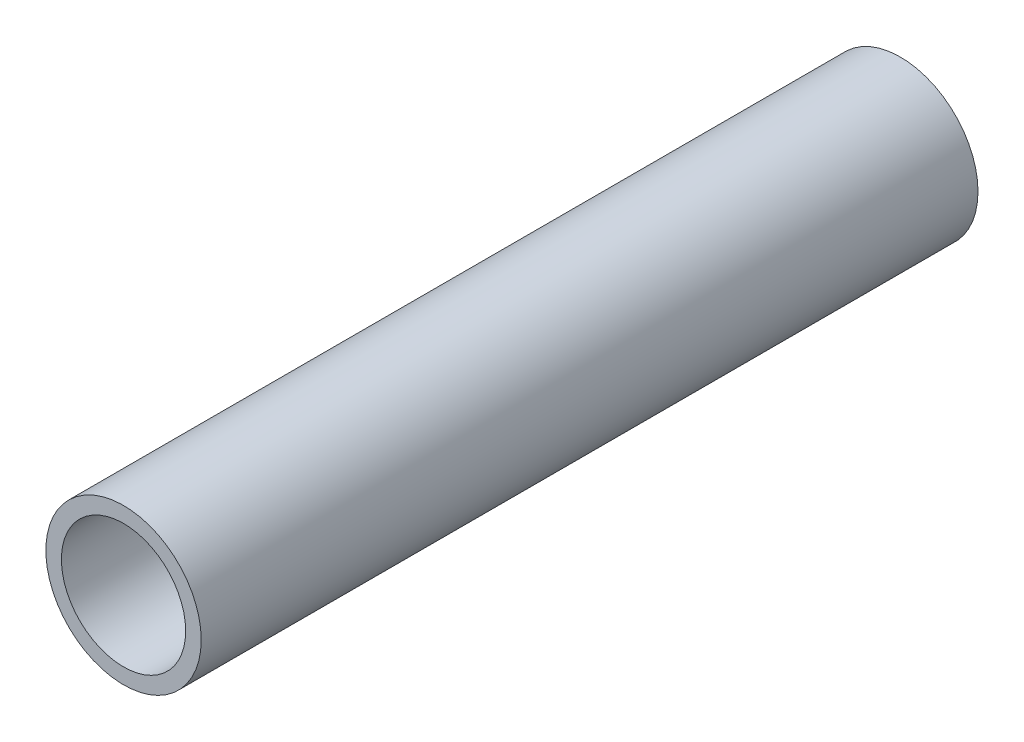
ISO-10303-21;
HEADER;
FILE_DESCRIPTION(('STEP AP214'),'2;1');
FILE_NAME('part.step','',(''),(''),'','','');
FILE_SCHEMA(('AUTOMOTIVE_DESIGN { 1 0 10303 214 1 1 1 1 }'));
ENDSEC;
DATA;
#1=APPLICATION_CONTEXT('core data for automotive mechanical design processes');
#2=APPLICATION_PROTOCOL_DEFINITION('international standard','automotive_design',2000,#1);
#3=PRODUCT_CONTEXT('',#1,'mechanical');
#4=PRODUCT('Part','Part','',(#3));
#5=PRODUCT_RELATED_PRODUCT_CATEGORY('part','',(#4));
#6=PRODUCT_DEFINITION_FORMATION('','',#4);
#7=PRODUCT_DEFINITION_CONTEXT('part definition',#1,'design');
#8=PRODUCT_DEFINITION('design','',#6,#7);
#9=PRODUCT_DEFINITION_SHAPE('','',#8);
#10=(LENGTH_UNIT() NAMED_UNIT(*) SI_UNIT(.MILLI.,.METRE.));
#11=(NAMED_UNIT(*) PLANE_ANGLE_UNIT() SI_UNIT($,.RADIAN.));
#12=(NAMED_UNIT(*) SI_UNIT($,.STERADIAN.) SOLID_ANGLE_UNIT());
#13=UNCERTAINTY_MEASURE_WITH_UNIT(LENGTH_MEASURE(1.E-05),#10,'distance_accuracy_value','');
#14=(GEOMETRIC_REPRESENTATION_CONTEXT(3) GLOBAL_UNCERTAINTY_ASSIGNED_CONTEXT((#13)) GLOBAL_UNIT_ASSIGNED_CONTEXT((#10,
#11,#12)) REPRESENTATION_CONTEXT('',''));
#15=CARTESIAN_POINT('',(0.,0.,0.));
#16=DIRECTION('',(0.,0.,1.));
#17=DIRECTION('',(1.,0.,0.));
#18=AXIS2_PLACEMENT_3D('',#15,#16,#17);
#19=CARTESIAN_POINT('',(0.,0.,127.));
#20=DIRECTION('',(0.,0.,1.));
#21=DIRECTION('',(1.,0.,0.));
#22=AXIS2_PLACEMENT_3D('',#19,#20,#21);
#23=PLANE('',#22);
#24=CARTESIAN_POINT('',(0.,0.,127.));
#25=DIRECTION('',(0.,0.,1.));
#26=DIRECTION('',(1.,0.,0.));
#27=AXIS2_PLACEMENT_3D('',#24,#25,#26);
#28=CIRCLE('',#27,12.7);
#29=CARTESIAN_POINT('',(12.7,0.,127.));
#30=VERTEX_POINT('',#29);
#31=EDGE_CURVE('E11',#30,#30,#28,.T.);
#32=ORIENTED_EDGE('',*,*,#31,.T.);
#33=EDGE_LOOP('',(#32));
#34=FACE_BOUND('',#33,.T.);
#35=CARTESIAN_POINT('',(0.,0.,127.));
#36=DIRECTION('',(0.,0.,1.));
#37=DIRECTION('',(1.,0.,0.));
#38=AXIS2_PLACEMENT_3D('',#35,#36,#37);
#39=CIRCLE('',#38,10.16);
#40=CARTESIAN_POINT('',(10.16,0.,127.));
#41=VERTEX_POINT('',#40);
#42=EDGE_CURVE('E51',#41,#41,#39,.T.);
#43=ORIENTED_EDGE('',*,*,#42,.F.);
#44=EDGE_LOOP('',(#43));
#45=FACE_BOUND('',#44,.T.);
#46=ADVANCED_FACE('F40',(#34,#45),#23,.T.);
#47=CARTESIAN_POINT('',(0.,0.,0.));
#48=DIRECTION('',(0.,0.,1.));
#49=DIRECTION('',(1.,0.,0.));
#50=AXIS2_PLACEMENT_3D('',#47,#48,#49);
#51=PLANE('',#50);
#52=CARTESIAN_POINT('',(0.,0.,0.));
#53=DIRECTION('',(0.,0.,1.));
#54=DIRECTION('',(1.,0.,0.));
#55=AXIS2_PLACEMENT_3D('',#52,#53,#54);
#56=CIRCLE('',#55,12.7);
#57=CARTESIAN_POINT('',(12.7,0.,0.));
#58=VERTEX_POINT('',#57);
#59=EDGE_CURVE('E44',#58,#58,#56,.T.);
#60=ORIENTED_EDGE('',*,*,#59,.F.);
#61=EDGE_LOOP('',(#60));
#62=FACE_BOUND('',#61,.T.);
#63=CARTESIAN_POINT('',(0.,0.,0.));
#64=DIRECTION('',(0.,0.,1.));
#65=DIRECTION('',(1.,0.,0.));
#66=AXIS2_PLACEMENT_3D('',#63,#64,#65);
#67=CIRCLE('',#66,10.16);
#68=CARTESIAN_POINT('',(10.16,0.,0.));
#69=VERTEX_POINT('',#68);
#70=EDGE_CURVE('E53',#69,#69,#67,.T.);
#71=ORIENTED_EDGE('',*,*,#70,.T.);
#72=EDGE_LOOP('',(#71));
#73=FACE_BOUND('',#72,.T.);
#74=ADVANCED_FACE('F63',(#62,#73),#51,.F.);
#75=CARTESIAN_POINT('',(0.,0.,127.));
#76=DIRECTION('',(0.,0.,-1.));
#77=DIRECTION('',(-1.,0.,0.));
#78=AXIS2_PLACEMENT_3D('',#75,#76,#77);
#79=CYLINDRICAL_SURFACE('',#78,12.7);
#80=ORIENTED_EDGE('',*,*,#31,.F.);
#81=EDGE_LOOP('',(#80));
#82=FACE_BOUND('',#81,.T.);
#83=ORIENTED_EDGE('',*,*,#59,.T.);
#84=EDGE_LOOP('',(#83));
#85=FACE_BOUND('',#84,.T.);
#86=ADVANCED_FACE('F42',(#82,#85),#79,.T.);
#87=CARTESIAN_POINT('',(0.,0.,127.));
#88=DIRECTION('',(0.,0.,-1.));
#89=DIRECTION('',(-1.,0.,0.));
#90=AXIS2_PLACEMENT_3D('',#87,#88,#89);
#91=CYLINDRICAL_SURFACE('',#90,10.16);
#92=ORIENTED_EDGE('',*,*,#42,.T.);
#93=EDGE_LOOP('',(#92));
#94=FACE_BOUND('',#93,.T.);
#95=ORIENTED_EDGE('',*,*,#70,.F.);
#96=EDGE_LOOP('',(#95));
#97=FACE_BOUND('',#96,.T.);
#98=ADVANCED_FACE('F59',(#94,#97),#91,.F.);
#99=CLOSED_SHELL('',(#46,#74,#86,#98));
#100=MANIFOLD_SOLID_BREP('B2',#99);
#101=ADVANCED_BREP_SHAPE_REPRESENTATION('',(#18,#100),#14);
#102=SHAPE_DEFINITION_REPRESENTATION(#9,#101);
ENDSEC;
END-ISO-10303-21;
